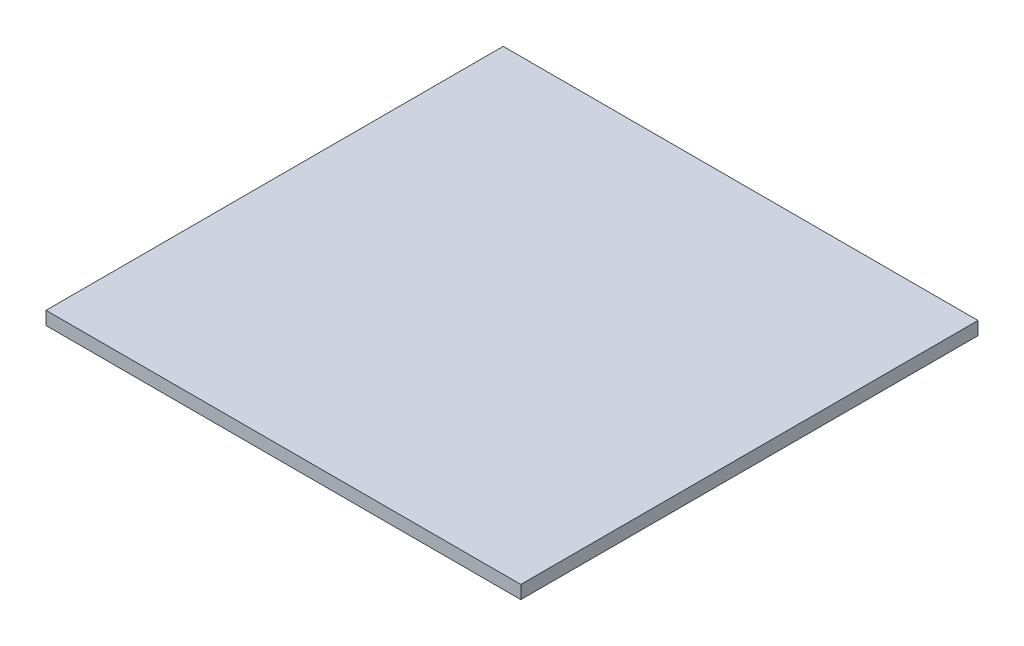
ISO-10303-21;
HEADER;
FILE_DESCRIPTION(('STEP AP214'),'2;1');
FILE_NAME('part.step','',(''),(''),'','','');
FILE_SCHEMA(('AUTOMOTIVE_DESIGN { 1 0 10303 214 1 1 1 1 }'));
ENDSEC;
DATA;
#1=APPLICATION_CONTEXT('core data for automotive mechanical design processes');
#2=APPLICATION_PROTOCOL_DEFINITION('international standard','automotive_design',2000,#1);
#3=PRODUCT_CONTEXT('',#1,'mechanical');
#4=PRODUCT('Part','Part','',(#3));
#5=PRODUCT_RELATED_PRODUCT_CATEGORY('part','',(#4));
#6=PRODUCT_DEFINITION_FORMATION('','',#4);
#7=PRODUCT_DEFINITION_CONTEXT('part definition',#1,'design');
#8=PRODUCT_DEFINITION('design','',#6,#7);
#9=PRODUCT_DEFINITION_SHAPE('','',#8);
#10=(LENGTH_UNIT() NAMED_UNIT(*) SI_UNIT(.MILLI.,.METRE.));
#11=(NAMED_UNIT(*) PLANE_ANGLE_UNIT() SI_UNIT($,.RADIAN.));
#12=(NAMED_UNIT(*) SI_UNIT($,.STERADIAN.) SOLID_ANGLE_UNIT());
#13=UNCERTAINTY_MEASURE_WITH_UNIT(LENGTH_MEASURE(1.E-05),#10,'distance_accuracy_value','');
#14=(GEOMETRIC_REPRESENTATION_CONTEXT(3) GLOBAL_UNCERTAINTY_ASSIGNED_CONTEXT((#13)) GLOBAL_UNIT_ASSIGNED_CONTEXT((#10,
#11,#12)) REPRESENTATION_CONTEXT('',''));
#15=CARTESIAN_POINT('',(0.,0.,0.));
#16=DIRECTION('',(0.,0.,1.));
#17=DIRECTION('',(1.,0.,0.));
#18=AXIS2_PLACEMENT_3D('',#15,#16,#17);
#19=CARTESIAN_POINT('',(0.,4.7625,0.));
#20=DIRECTION('',(1.,0.,0.));
#21=DIRECTION('',(0.,0.,-1.));
#22=AXIS2_PLACEMENT_3D('',#19,#20,#21);
#23=PLANE('',#22);
#24=DIRECTION('',(0.,0.,1.));
#25=VECTOR('',#24,1.);
#26=CARTESIAN_POINT('',(0.,0.,0.));
#27=LINE('',#26,#25);
#28=CARTESIAN_POINT('',(0.,0.,0.));
#29=VERTEX_POINT('',#28);
#30=CARTESIAN_POINT('',(0.,0.,165.1));
#31=VERTEX_POINT('',#30);
#32=EDGE_CURVE('E96',#29,#31,#27,.T.);
#33=ORIENTED_EDGE('',*,*,#32,.T.);
#34=DIRECTION('',(0.,-1.,0.));
#35=VECTOR('',#34,1.);
#36=CARTESIAN_POINT('',(0.,4.7625,165.1));
#37=LINE('',#36,#35);
#38=CARTESIAN_POINT('',(0.,4.7625,165.1));
#39=VERTEX_POINT('',#38);
#40=EDGE_CURVE('E11',#39,#31,#37,.T.);
#41=ORIENTED_EDGE('',*,*,#40,.F.);
#42=DIRECTION('',(0.,0.,1.));
#43=VECTOR('',#42,1.);
#44=CARTESIAN_POINT('',(0.,4.7625,0.));
#45=LINE('',#44,#43);
#46=CARTESIAN_POINT('',(0.,4.7625,0.));
#47=VERTEX_POINT('',#46);
#48=EDGE_CURVE('E82',#47,#39,#45,.T.);
#49=ORIENTED_EDGE('',*,*,#48,.F.);
#50=DIRECTION('',(0.,-1.,0.));
#51=VECTOR('',#50,1.);
#52=CARTESIAN_POINT('',(0.,4.7625,0.));
#53=LINE('',#52,#51);
#54=EDGE_CURVE('E49',#47,#29,#53,.T.);
#55=ORIENTED_EDGE('',*,*,#54,.T.);
#56=EDGE_LOOP('',(#33,#41,#49,#55));
#57=FACE_BOUND('',#56,.T.);
#58=ADVANCED_FACE('F33',(#57),#23,.F.);
#59=CARTESIAN_POINT('',(0.,4.7625,165.1));
#60=DIRECTION('',(0.,0.,-1.));
#61=DIRECTION('',(-1.,0.,0.));
#62=AXIS2_PLACEMENT_3D('',#59,#60,#61);
#63=PLANE('',#62);
#64=DIRECTION('',(1.,0.,0.));
#65=VECTOR('',#64,1.);
#66=CARTESIAN_POINT('',(0.,0.,165.1));
#67=LINE('',#66,#65);
#68=CARTESIAN_POINT('',(171.45,0.,165.1));
#69=VERTEX_POINT('',#68);
#70=EDGE_CURVE('E87',#31,#69,#67,.T.);
#71=ORIENTED_EDGE('',*,*,#70,.T.);
#72=DIRECTION('',(0.,-1.,0.));
#73=VECTOR('',#72,1.);
#74=CARTESIAN_POINT('',(171.45,4.7625,165.1));
#75=LINE('',#74,#73);
#76=CARTESIAN_POINT('',(171.45,4.7625,165.1));
#77=VERTEX_POINT('',#76);
#78=EDGE_CURVE('E41',#77,#69,#75,.T.);
#79=ORIENTED_EDGE('',*,*,#78,.F.);
#80=DIRECTION('',(1.,0.,0.));
#81=VECTOR('',#80,1.);
#82=CARTESIAN_POINT('',(0.,4.7625,165.1));
#83=LINE('',#82,#81);
#84=EDGE_CURVE('E74',#39,#77,#83,.T.);
#85=ORIENTED_EDGE('',*,*,#84,.F.);
#86=ORIENTED_EDGE('',*,*,#40,.T.);
#87=EDGE_LOOP('',(#71,#79,#85,#86));
#88=FACE_BOUND('',#87,.T.);
#89=ADVANCED_FACE('F86',(#88),#63,.F.);
#90=CARTESIAN_POINT('',(171.45,4.7625,0.));
#91=DIRECTION('',(1.,0.,0.));
#92=DIRECTION('',(0.,0.,-1.));
#93=AXIS2_PLACEMENT_3D('',#90,#91,#92);
#94=PLANE('',#93);
#95=DIRECTION('',(0.,0.,1.));
#96=VECTOR('',#95,1.);
#97=CARTESIAN_POINT('',(171.45,0.,0.));
#98=LINE('',#97,#96);
#99=CARTESIAN_POINT('',(171.45,0.,0.));
#100=VERTEX_POINT('',#99);
#101=EDGE_CURVE('E99',#100,#69,#98,.T.);
#102=ORIENTED_EDGE('',*,*,#101,.F.);
#103=DIRECTION('',(0.,-1.,0.));
#104=VECTOR('',#103,1.);
#105=CARTESIAN_POINT('',(171.45,4.7625,0.));
#106=LINE('',#105,#104);
#107=CARTESIAN_POINT('',(171.45,4.7625,0.));
#108=VERTEX_POINT('',#107);
#109=EDGE_CURVE('E63',#108,#100,#106,.T.);
#110=ORIENTED_EDGE('',*,*,#109,.F.);
#111=DIRECTION('',(0.,0.,1.));
#112=VECTOR('',#111,1.);
#113=CARTESIAN_POINT('',(171.45,4.7625,0.));
#114=LINE('',#113,#112);
#115=EDGE_CURVE('E81',#108,#77,#114,.T.);
#116=ORIENTED_EDGE('',*,*,#115,.T.);
#117=ORIENTED_EDGE('',*,*,#78,.T.);
#118=EDGE_LOOP('',(#102,#110,#116,#117));
#119=FACE_BOUND('',#118,.T.);
#120=ADVANCED_FACE('F90',(#119),#94,.T.);
#121=CARTESIAN_POINT('',(0.,4.7625,0.));
#122=DIRECTION('',(0.,0.,-1.));
#123=DIRECTION('',(-1.,0.,0.));
#124=AXIS2_PLACEMENT_3D('',#121,#122,#123);
#125=PLANE('',#124);
#126=DIRECTION('',(1.,0.,0.));
#127=VECTOR('',#126,1.);
#128=CARTESIAN_POINT('',(0.,0.,0.));
#129=LINE('',#128,#127);
#130=EDGE_CURVE('E101',#29,#100,#129,.T.);
#131=ORIENTED_EDGE('',*,*,#130,.F.);
#132=ORIENTED_EDGE('',*,*,#54,.F.);
#133=DIRECTION('',(1.,0.,0.));
#134=VECTOR('',#133,1.);
#135=CARTESIAN_POINT('',(0.,4.7625,0.));
#136=LINE('',#135,#134);
#137=EDGE_CURVE('E91',#47,#108,#136,.T.);
#138=ORIENTED_EDGE('',*,*,#137,.T.);
#139=ORIENTED_EDGE('',*,*,#109,.T.);
#140=EDGE_LOOP('',(#131,#132,#138,#139));
#141=FACE_BOUND('',#140,.T.);
#142=ADVANCED_FACE('F107',(#141),#125,.T.);
#143=CARTESIAN_POINT('',(0.,4.7625,0.));
#144=DIRECTION('',(0.,1.,0.));
#145=DIRECTION('',(0.,0.,1.));
#146=AXIS2_PLACEMENT_3D('',#143,#144,#145);
#147=PLANE('',#146);
#148=ORIENTED_EDGE('',*,*,#48,.T.);
#149=ORIENTED_EDGE('',*,*,#84,.T.);
#150=ORIENTED_EDGE('',*,*,#115,.F.);
#151=ORIENTED_EDGE('',*,*,#137,.F.);
#152=EDGE_LOOP('',(#148,#149,#150,#151));
#153=FACE_BOUND('',#152,.T.);
#154=ADVANCED_FACE('F78',(#153),#147,.T.);
#155=CARTESIAN_POINT('',(0.,0.,0.));
#156=DIRECTION('',(0.,1.,0.));
#157=DIRECTION('',(0.,0.,1.));
#158=AXIS2_PLACEMENT_3D('',#155,#156,#157);
#159=PLANE('',#158);
#160=ORIENTED_EDGE('',*,*,#32,.F.);
#161=ORIENTED_EDGE('',*,*,#130,.T.);
#162=ORIENTED_EDGE('',*,*,#101,.T.);
#163=ORIENTED_EDGE('',*,*,#70,.F.);
#164=EDGE_LOOP('',(#160,#161,#162,#163));
#165=FACE_BOUND('',#164,.T.);
#166=ADVANCED_FACE('F106',(#165),#159,.F.);
#167=CLOSED_SHELL('',(#58,#89,#120,#142,#154,#166));
#168=MANIFOLD_SOLID_BREP('B2',#167);
#169=ADVANCED_BREP_SHAPE_REPRESENTATION('',(#18,#168),#14);
#170=SHAPE_DEFINITION_REPRESENTATION(#9,#169);
ENDSEC;
END-ISO-10303-21;
